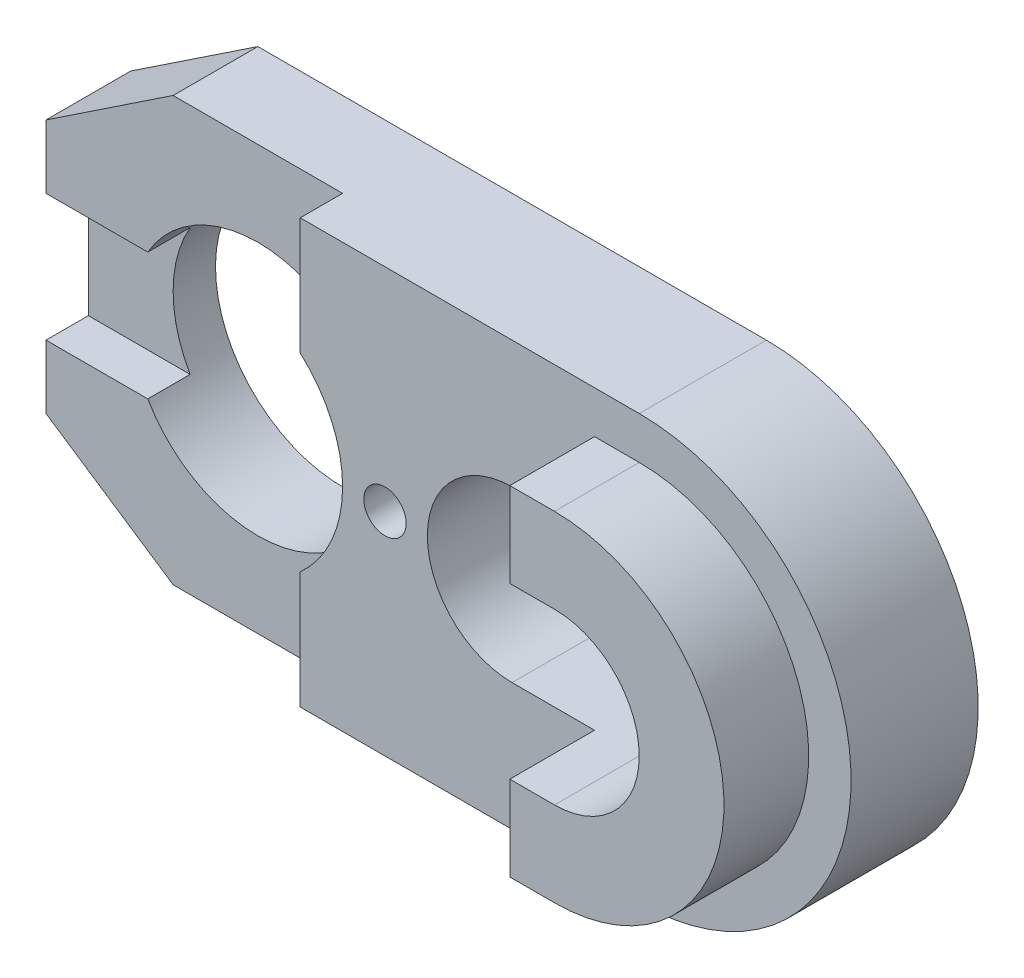
ISO-10303-21;
HEADER;
FILE_DESCRIPTION(('STEP AP214'),'2;1');
FILE_NAME('part.step','',(''),(''),'','','');
FILE_SCHEMA(('AUTOMOTIVE_DESIGN { 1 0 10303 214 1 1 1 1 }'));
ENDSEC;
DATA;
#1=APPLICATION_CONTEXT('core data for automotive mechanical design processes');
#2=APPLICATION_PROTOCOL_DEFINITION('international standard','automotive_design',2000,#1);
#3=PRODUCT_CONTEXT('',#1,'mechanical');
#4=PRODUCT('Part','Part','',(#3));
#5=PRODUCT_RELATED_PRODUCT_CATEGORY('part','',(#4));
#6=PRODUCT_DEFINITION_FORMATION('','',#4);
#7=PRODUCT_DEFINITION_CONTEXT('part definition',#1,'design');
#8=PRODUCT_DEFINITION('design','',#6,#7);
#9=PRODUCT_DEFINITION_SHAPE('','',#8);
#10=(LENGTH_UNIT() NAMED_UNIT(*) SI_UNIT(.MILLI.,.METRE.));
#11=(NAMED_UNIT(*) PLANE_ANGLE_UNIT() SI_UNIT($,.RADIAN.));
#12=(NAMED_UNIT(*) SI_UNIT($,.STERADIAN.) SOLID_ANGLE_UNIT());
#13=UNCERTAINTY_MEASURE_WITH_UNIT(LENGTH_MEASURE(1.E-05),#10,'distance_accuracy_value','');
#14=(GEOMETRIC_REPRESENTATION_CONTEXT(3) GLOBAL_UNCERTAINTY_ASSIGNED_CONTEXT((#13)) GLOBAL_UNIT_ASSIGNED_CONTEXT((#10,
#11,#12)) REPRESENTATION_CONTEXT('',''));
#15=CARTESIAN_POINT('',(0.,0.,0.));
#16=DIRECTION('',(0.,0.,1.));
#17=DIRECTION('',(1.,0.,0.));
#18=AXIS2_PLACEMENT_3D('',#15,#16,#17);
#19=CARTESIAN_POINT('',(-9.49576410080812,-20.,2.));
#20=DIRECTION('',(0.,0.,-1.));
#21=DIRECTION('',(-1.,0.,0.));
#22=AXIS2_PLACEMENT_3D('',#19,#20,#21);
#23=PLANE('',#22);
#24=CARTESIAN_POINT('',(-4.49576410080812,0.,2.));
#25=DIRECTION('',(0.,0.,-1.));
#26=DIRECTION('',(-1.,0.,0.));
#27=AXIS2_PLACEMENT_3D('',#24,#25,#26);
#28=CIRCLE('',#27,3.);
#29=CARTESIAN_POINT('',(-2.49576410080812,-2.23606797749979,2.));
#30=VERTEX_POINT('',#29);
#31=CARTESIAN_POINT('',(-7.09384031216144,-1.5,2.));
#32=VERTEX_POINT('',#31);
#33=EDGE_CURVE('E453',#30,#32,#28,.T.);
#34=ORIENTED_EDGE('',*,*,#33,.T.);
#35=DIRECTION('',(-1.,0.,0.));
#36=VECTOR('',#35,1.);
#37=CARTESIAN_POINT('',(-9.49576410080812,-1.5,2.));
#38=LINE('',#37,#36);
#39=CARTESIAN_POINT('',(-9.49576410080812,-1.5,2.));
#40=VERTEX_POINT('',#39);
#41=EDGE_CURVE('E161',#32,#40,#38,.T.);
#42=ORIENTED_EDGE('',*,*,#41,.T.);
#43=DIRECTION('',(0.,1.,0.));
#44=VECTOR('',#43,1.);
#45=CARTESIAN_POINT('',(-9.49576410080812,-20.,2.));
#46=LINE('',#45,#44);
#47=CARTESIAN_POINT('',(-9.49576410080812,-3.,2.));
#48=VERTEX_POINT('',#47);
#49=EDGE_CURVE('E334',#48,#40,#46,.T.);
#50=ORIENTED_EDGE('',*,*,#49,.F.);
#51=DIRECTION('',(-0.832050294337844,0.554700196225229,0.));
#52=VECTOR('',#51,1.);
#53=CARTESIAN_POINT('',(-9.49576410080812,-3.,2.));
#54=LINE('',#53,#52);
#55=CARTESIAN_POINT('',(-6.49576410080812,-5.,2.));
#56=VERTEX_POINT('',#55);
#57=EDGE_CURVE('E376',#56,#48,#54,.T.);
#58=ORIENTED_EDGE('',*,*,#57,.F.);
#59=DIRECTION('',(-1.,0.,0.));
#60=VECTOR('',#59,1.);
#61=CARTESIAN_POINT('',(-6.49576410080812,-5.,2.));
#62=LINE('',#61,#60);
#63=CARTESIAN_POINT('',(-2.49576410080812,-5.,2.));
#64=VERTEX_POINT('',#63);
#65=EDGE_CURVE('E373',#64,#56,#62,.T.);
#66=ORIENTED_EDGE('',*,*,#65,.F.);
#67=DIRECTION('',(0.,1.,0.));
#68=VECTOR('',#67,1.);
#69=CARTESIAN_POINT('',(-2.49576410080812,-20.,2.));
#70=LINE('',#69,#68);
#71=EDGE_CURVE('E335',#64,#30,#70,.T.);
#72=ORIENTED_EDGE('',*,*,#71,.T.);
#73=EDGE_LOOP('',(#34,#42,#50,#58,#66,#72));
#74=FACE_BOUND('',#73,.T.);
#75=ADVANCED_FACE('F153',(#74),#23,.F.);
#76=CARTESIAN_POINT('',(5.50423589919188,0.,5.));
#77=DIRECTION('',(0.,0.,-1.));
#78=DIRECTION('',(-1.,0.,0.));
#79=AXIS2_PLACEMENT_3D('',#76,#77,#78);
#80=PLANE('',#79);
#81=DIRECTION('',(-1.,0.,0.));
#82=VECTOR('',#81,1.);
#83=CARTESIAN_POINT('',(0.,-4.,5.));
#84=LINE('',#83,#82);
#85=CARTESIAN_POINT('',(5.50423589919188,-4.,5.));
#86=VERTEX_POINT('',#85);
#87=CARTESIAN_POINT('',(4.45006127435356,-4.,5.));
#88=VERTEX_POINT('',#87);
#89=EDGE_CURVE('E492',#86,#88,#84,.T.);
#90=ORIENTED_EDGE('',*,*,#89,.F.);
#91=CARTESIAN_POINT('',(5.50423589919188,0.,5.));
#92=DIRECTION('',(0.,0.,1.));
#93=DIRECTION('',(1.,0.,0.));
#94=AXIS2_PLACEMENT_3D('',#91,#92,#93);
#95=CIRCLE('',#94,4.);
#96=CARTESIAN_POINT('',(5.50423589919188,4.,5.));
#97=VERTEX_POINT('',#96);
#98=EDGE_CURVE('E506',#86,#97,#95,.T.);
#99=ORIENTED_EDGE('',*,*,#98,.T.);
#100=DIRECTION('',(-1.,0.,0.));
#101=VECTOR('',#100,1.);
#102=CARTESIAN_POINT('',(0.,4.,5.));
#103=LINE('',#102,#101);
#104=CARTESIAN_POINT('',(4.45006127435356,4.,5.));
#105=VERTEX_POINT('',#104);
#106=EDGE_CURVE('E513',#97,#105,#103,.T.);
#107=ORIENTED_EDGE('',*,*,#106,.T.);
#108=DIRECTION('',(0.,1.,0.));
#109=VECTOR('',#108,1.);
#110=CARTESIAN_POINT('',(4.45006127435356,-20.,5.));
#111=LINE('',#110,#109);
#112=CARTESIAN_POINT('',(4.45006127435356,2.,5.));
#113=VERTEX_POINT('',#112);
#114=EDGE_CURVE('E352',#113,#105,#111,.T.);
#115=ORIENTED_EDGE('',*,*,#114,.F.);
#116=DIRECTION('',(-1.,0.,0.));
#117=VECTOR('',#116,1.);
#118=CARTESIAN_POINT('',(2.50423589919188,2.,5.));
#119=LINE('',#118,#117);
#120=CARTESIAN_POINT('',(5.50423589919188,2.,5.));
#121=VERTEX_POINT('',#120);
#122=EDGE_CURVE('E386',#121,#113,#119,.T.);
#123=ORIENTED_EDGE('',*,*,#122,.F.);
#124=CARTESIAN_POINT('',(5.50423589919188,0.,5.));
#125=DIRECTION('',(0.,0.,1.));
#126=DIRECTION('',(1.,0.,0.));
#127=AXIS2_PLACEMENT_3D('',#124,#125,#126);
#128=CIRCLE('',#127,2.);
#129=CARTESIAN_POINT('',(5.50423589919188,-2.,5.));
#130=VERTEX_POINT('',#129);
#131=EDGE_CURVE('E382',#130,#121,#128,.T.);
#132=ORIENTED_EDGE('',*,*,#131,.F.);
#133=DIRECTION('',(1.,0.,0.));
#134=VECTOR('',#133,1.);
#135=CARTESIAN_POINT('',(2.50423589919188,-2.,5.));
#136=LINE('',#135,#134);
#137=CARTESIAN_POINT('',(4.45006127435356,-2.,5.));
#138=VERTEX_POINT('',#137);
#139=EDGE_CURVE('E380',#138,#130,#136,.T.);
#140=ORIENTED_EDGE('',*,*,#139,.F.);
#141=EDGE_CURVE('E351',#88,#138,#111,.T.);
#142=ORIENTED_EDGE('',*,*,#141,.F.);
#143=EDGE_LOOP('',(#90,#99,#107,#115,#123,#132,#140,#142));
#144=FACE_BOUND('',#143,.T.);
#145=ADVANCED_FACE('F585',(#144),#80,.F.);
#146=CARTESIAN_POINT('',(5.50423589919188,0.,5.));
#147=DIRECTION('',(0.,0.,-1.));
#148=DIRECTION('',(-1.,0.,0.));
#149=AXIS2_PLACEMENT_3D('',#146,#147,#148);
#150=CYLINDRICAL_SURFACE('',#149,5.);
#151=CARTESIAN_POINT('',(5.50423589919188,0.,3.));
#152=DIRECTION('',(0.,0.,-1.));
#153=DIRECTION('',(-1.,0.,0.));
#154=AXIS2_PLACEMENT_3D('',#151,#152,#153);
#155=CIRCLE('',#154,5.);
#156=CARTESIAN_POINT('',(5.50423589919188,5.,3.));
#157=VERTEX_POINT('',#156);
#158=CARTESIAN_POINT('',(5.50423589919188,-5.,3.));
#159=VERTEX_POINT('',#158);
#160=EDGE_CURVE('E320',#157,#159,#155,.T.);
#161=ORIENTED_EDGE('',*,*,#160,.T.);
#162=DIRECTION('',(0.,0.,-1.));
#163=VECTOR('',#162,1.);
#164=CARTESIAN_POINT('',(5.50423589919188,-5.,5.));
#165=LINE('',#164,#163);
#166=CARTESIAN_POINT('',(5.50423589919188,-5.,0.));
#167=VERTEX_POINT('',#166);
#168=EDGE_CURVE('E437',#159,#167,#165,.T.);
#169=ORIENTED_EDGE('',*,*,#168,.T.);
#170=CARTESIAN_POINT('',(5.50423589919188,0.,0.));
#171=DIRECTION('',(0.,0.,1.));
#172=DIRECTION('',(-1.,0.,0.));
#173=AXIS2_PLACEMENT_3D('',#170,#171,#172);
#174=CIRCLE('',#173,5.);
#175=CARTESIAN_POINT('',(5.50423589919188,5.,0.));
#176=VERTEX_POINT('',#175);
#177=EDGE_CURVE('E422',#167,#176,#174,.T.);
#178=ORIENTED_EDGE('',*,*,#177,.T.);
#179=DIRECTION('',(0.,0.,-1.));
#180=VECTOR('',#179,1.);
#181=CARTESIAN_POINT('',(5.50423589919188,5.,5.));
#182=LINE('',#181,#180);
#183=EDGE_CURVE('E435',#157,#176,#182,.T.);
#184=ORIENTED_EDGE('',*,*,#183,.F.);
#185=EDGE_LOOP('',(#161,#169,#178,#184));
#186=FACE_BOUND('',#185,.T.);
#187=ADVANCED_FACE('F539',(#186),#150,.T.);
#188=CARTESIAN_POINT('',(-6.49576410080812,-5.,5.));
#189=DIRECTION('',(0.,1.,0.));
#190=DIRECTION('',(0.,0.,1.));
#191=AXIS2_PLACEMENT_3D('',#188,#189,#190);
#192=PLANE('',#191);
#193=ORIENTED_EDGE('',*,*,#168,.F.);
#194=DIRECTION('',(-1.,0.,0.));
#195=VECTOR('',#194,1.);
#196=CARTESIAN_POINT('',(-6.49576410080812,-5.,3.));
#197=LINE('',#196,#195);
#198=CARTESIAN_POINT('',(-2.49576410080812,-5.,3.));
#199=VERTEX_POINT('',#198);
#200=EDGE_CURVE('E366',#159,#199,#197,.T.);
#201=ORIENTED_EDGE('',*,*,#200,.T.);
#202=DIRECTION('',(0.,0.,-1.));
#203=VECTOR('',#202,1.);
#204=CARTESIAN_POINT('',(-2.49576410080812,-5.,5.));
#205=LINE('',#204,#203);
#206=EDGE_CURVE('E369',#199,#64,#205,.T.);
#207=ORIENTED_EDGE('',*,*,#206,.T.);
#208=ORIENTED_EDGE('',*,*,#65,.T.);
#209=DIRECTION('',(0.,0.,-1.));
#210=VECTOR('',#209,1.);
#211=CARTESIAN_POINT('',(-6.49576410080812,-5.,5.));
#212=LINE('',#211,#210);
#213=CARTESIAN_POINT('',(-6.49576410080812,-5.,0.));
#214=VERTEX_POINT('',#213);
#215=EDGE_CURVE('E439',#56,#214,#212,.T.);
#216=ORIENTED_EDGE('',*,*,#215,.T.);
#217=DIRECTION('',(1.,0.,0.));
#218=VECTOR('',#217,1.);
#219=CARTESIAN_POINT('',(-6.49576410080812,-5.,0.));
#220=LINE('',#219,#218);
#221=EDGE_CURVE('E419',#214,#167,#220,.T.);
#222=ORIENTED_EDGE('',*,*,#221,.T.);
#223=EDGE_LOOP('',(#193,#201,#207,#208,#216,#222));
#224=FACE_BOUND('',#223,.T.);
#225=ADVANCED_FACE('F477',(#224),#192,.F.);
#226=CARTESIAN_POINT('',(-6.49576410080812,5.,5.));
#227=DIRECTION('',(0.,-1.,0.));
#228=DIRECTION('',(1.,0.,0.));
#229=AXIS2_PLACEMENT_3D('',#226,#227,#228);
#230=PLANE('',#229);
#231=DIRECTION('',(-1.,0.,0.));
#232=VECTOR('',#231,1.);
#233=CARTESIAN_POINT('',(-2.49576410080812,5.,3.));
#234=LINE('',#233,#232);
#235=CARTESIAN_POINT('',(-2.49576410080812,5.,3.));
#236=VERTEX_POINT('',#235);
#237=EDGE_CURVE('E523',#157,#236,#234,.T.);
#238=ORIENTED_EDGE('',*,*,#237,.F.);
#239=ORIENTED_EDGE('',*,*,#183,.T.);
#240=DIRECTION('',(-1.,0.,0.));
#241=VECTOR('',#240,1.);
#242=CARTESIAN_POINT('',(-6.49576410080812,5.,0.));
#243=LINE('',#242,#241);
#244=CARTESIAN_POINT('',(-6.49576410080812,5.,0.));
#245=VERTEX_POINT('',#244);
#246=EDGE_CURVE('E425',#176,#245,#243,.T.);
#247=ORIENTED_EDGE('',*,*,#246,.T.);
#248=DIRECTION('',(0.,0.,-1.));
#249=VECTOR('',#248,1.);
#250=CARTESIAN_POINT('',(-6.49576410080812,5.,5.));
#251=LINE('',#250,#249);
#252=CARTESIAN_POINT('',(-6.49576410080812,5.,2.));
#253=VERTEX_POINT('',#252);
#254=EDGE_CURVE('E433',#253,#245,#251,.T.);
#255=ORIENTED_EDGE('',*,*,#254,.F.);
#256=DIRECTION('',(-1.,0.,0.));
#257=VECTOR('',#256,1.);
#258=CARTESIAN_POINT('',(-9.49576410080812,5.,2.));
#259=LINE('',#258,#257);
#260=CARTESIAN_POINT('',(-2.49576410080812,5.,2.));
#261=VERTEX_POINT('',#260);
#262=EDGE_CURVE('E342',#261,#253,#259,.T.);
#263=ORIENTED_EDGE('',*,*,#262,.F.);
#264=DIRECTION('',(0.,0.,-1.));
#265=VECTOR('',#264,1.);
#266=CARTESIAN_POINT('',(-2.49576410080812,5.,2.));
#267=LINE('',#266,#265);
#268=EDGE_CURVE('E525',#236,#261,#267,.T.);
#269=ORIENTED_EDGE('',*,*,#268,.F.);
#270=EDGE_LOOP('',(#238,#239,#247,#255,#263,#269));
#271=FACE_BOUND('',#270,.T.);
#272=ADVANCED_FACE('F535',(#271),#230,.F.);
#273=CARTESIAN_POINT('',(4.45006127435356,-20.,3.));
#274=DIRECTION('',(1.,0.,0.));
#275=DIRECTION('',(0.,1.,0.));
#276=AXIS2_PLACEMENT_3D('',#273,#274,#275);
#277=PLANE('',#276);
#278=DIRECTION('',(0.,0.,1.));
#279=VECTOR('',#278,1.);
#280=CARTESIAN_POINT('',(4.45006127435356,4.,3.));
#281=LINE('',#280,#279);
#282=CARTESIAN_POINT('',(4.45006127435356,4.,3.));
#283=VERTEX_POINT('',#282);
#284=EDGE_CURVE('E515',#283,#105,#281,.T.);
#285=ORIENTED_EDGE('',*,*,#284,.F.);
#286=DIRECTION('',(0.,1.,0.));
#287=VECTOR('',#286,1.);
#288=CARTESIAN_POINT('',(4.45006127435356,-20.,3.));
#289=LINE('',#288,#287);
#290=CARTESIAN_POINT('',(4.45006127435356,2.,3.));
#291=VERTEX_POINT('',#290);
#292=EDGE_CURVE('E348',#291,#283,#289,.T.);
#293=ORIENTED_EDGE('',*,*,#292,.F.);
#294=DIRECTION('',(0.,0.,1.));
#295=VECTOR('',#294,1.);
#296=CARTESIAN_POINT('',(4.45006127435356,2.,5.));
#297=LINE('',#296,#295);
#298=EDGE_CURVE('E443',#291,#113,#297,.T.);
#299=ORIENTED_EDGE('',*,*,#298,.T.);
#300=ORIENTED_EDGE('',*,*,#114,.T.);
#301=EDGE_LOOP('',(#285,#293,#299,#300));
#302=FACE_BOUND('',#301,.T.);
#303=ADVANCED_FACE('F557',(#302),#277,.F.);
#304=CARTESIAN_POINT('',(5.50423589919188,0.,0.));
#305=DIRECTION('',(0.,0.,-1.));
#306=DIRECTION('',(-1.,0.,0.));
#307=AXIS2_PLACEMENT_3D('',#304,#305,#306);
#308=PLANE('',#307);
#309=CARTESIAN_POINT('',(-4.49576410080812,0.,0.));
#310=DIRECTION('',(0.,0.,1.));
#311=DIRECTION('',(1.,0.,0.));
#312=AXIS2_PLACEMENT_3D('',#309,#310,#311);
#313=CIRCLE('',#312,3.);
#314=CARTESIAN_POINT('',(-1.49576410080812,0.,0.));
#315=VERTEX_POINT('',#314);
#316=EDGE_CURVE('E410',#315,#315,#313,.T.);
#317=ORIENTED_EDGE('',*,*,#316,.T.);
#318=EDGE_LOOP('',(#317));
#319=FACE_BOUND('',#318,.T.);
#320=DIRECTION('',(0.,-1.,0.));
#321=VECTOR('',#320,1.);
#322=CARTESIAN_POINT('',(-9.49576410080812,-3.,0.));
#323=LINE('',#322,#321);
#324=CARTESIAN_POINT('',(-9.49576410080812,3.,0.));
#325=VERTEX_POINT('',#324);
#326=CARTESIAN_POINT('',(-9.49576410080812,-3.,0.));
#327=VERTEX_POINT('',#326);
#328=EDGE_CURVE('E413',#325,#327,#323,.T.);
#329=ORIENTED_EDGE('',*,*,#328,.F.);
#330=DIRECTION('',(-0.832050294337844,-0.554700196225229,0.));
#331=VECTOR('',#330,1.);
#332=CARTESIAN_POINT('',(-9.49576410080812,3.,0.));
#333=LINE('',#332,#331);
#334=EDGE_CURVE('E428',#245,#325,#333,.T.);
#335=ORIENTED_EDGE('',*,*,#334,.F.);
#336=ORIENTED_EDGE('',*,*,#246,.F.);
#337=ORIENTED_EDGE('',*,*,#177,.F.);
#338=ORIENTED_EDGE('',*,*,#221,.F.);
#339=DIRECTION('',(0.832050294337844,-0.554700196225229,0.));
#340=VECTOR('',#339,1.);
#341=CARTESIAN_POINT('',(-9.49576410080812,-3.,0.));
#342=LINE('',#341,#340);
#343=EDGE_CURVE('E416',#327,#214,#342,.T.);
#344=ORIENTED_EDGE('',*,*,#343,.F.);
#345=EDGE_LOOP('',(#329,#335,#336,#337,#338,#344));
#346=FACE_BOUND('',#345,.T.);
#347=CARTESIAN_POINT('',(-0.495764100808119,0.,0.));
#348=DIRECTION('',(0.,0.,1.));
#349=DIRECTION('',(1.,0.,0.));
#350=AXIS2_PLACEMENT_3D('',#347,#348,#349);
#351=CIRCLE('',#350,0.5);
#352=CARTESIAN_POINT('',(0.004235899191881,0.,0.));
#353=VERTEX_POINT('',#352);
#354=EDGE_CURVE('E407',#353,#353,#351,.T.);
#355=ORIENTED_EDGE('',*,*,#354,.T.);
#356=EDGE_LOOP('',(#355));
#357=FACE_BOUND('',#356,.T.);
#358=DIRECTION('',(-1.,0.,0.));
#359=VECTOR('',#358,1.);
#360=CARTESIAN_POINT('',(2.50423589919188,2.,0.));
#361=LINE('',#360,#359);
#362=CARTESIAN_POINT('',(5.50423589919188,2.,0.));
#363=VERTEX_POINT('',#362);
#364=CARTESIAN_POINT('',(2.50423589919188,2.,0.));
#365=VERTEX_POINT('',#364);
#366=EDGE_CURVE('E383',#363,#365,#361,.T.);
#367=ORIENTED_EDGE('',*,*,#366,.T.);
#368=CARTESIAN_POINT('',(2.50423589919188,0.,0.));
#369=DIRECTION('',(0.,0.,1.));
#370=DIRECTION('',(1.,0.,0.));
#371=AXIS2_PLACEMENT_3D('',#368,#369,#370);
#372=CIRCLE('',#371,2.);
#373=CARTESIAN_POINT('',(2.50423589919188,-2.,0.));
#374=VERTEX_POINT('',#373);
#375=EDGE_CURVE('E379',#365,#374,#372,.T.);
#376=ORIENTED_EDGE('',*,*,#375,.T.);
#377=DIRECTION('',(1.,0.,0.));
#378=VECTOR('',#377,1.);
#379=CARTESIAN_POINT('',(2.50423589919188,-2.,0.));
#380=LINE('',#379,#378);
#381=CARTESIAN_POINT('',(5.50423589919188,-2.,0.));
#382=VERTEX_POINT('',#381);
#383=EDGE_CURVE('E392',#374,#382,#380,.T.);
#384=ORIENTED_EDGE('',*,*,#383,.T.);
#385=CARTESIAN_POINT('',(5.50423589919188,0.,0.));
#386=DIRECTION('',(0.,0.,1.));
#387=DIRECTION('',(1.,0.,0.));
#388=AXIS2_PLACEMENT_3D('',#385,#386,#387);
#389=CIRCLE('',#388,2.);
#390=EDGE_CURVE('E395',#382,#363,#389,.T.);
#391=ORIENTED_EDGE('',*,*,#390,.T.);
#392=EDGE_LOOP('',(#367,#376,#384,#391));
#393=FACE_BOUND('',#392,.T.);
#394=ADVANCED_FACE('F470',(#319,#346,#357,#393),#308,.T.);
#395=CARTESIAN_POINT('',(-9.49576410080812,-3.,5.));
#396=DIRECTION('',(1.,0.,0.));
#397=DIRECTION('',(0.,0.,-1.));
#398=AXIS2_PLACEMENT_3D('',#395,#396,#397);
#399=PLANE('',#398);
#400=ORIENTED_EDGE('',*,*,#49,.T.);
#401=DIRECTION('',(0.,0.,1.));
#402=VECTOR('',#401,1.);
#403=CARTESIAN_POINT('',(-9.49576410080812,-1.5,2.));
#404=LINE('',#403,#402);
#405=CARTESIAN_POINT('',(-9.49576410080812,-1.5,0.999999999999999));
#406=VERTEX_POINT('',#405);
#407=EDGE_CURVE('E462',#406,#40,#404,.T.);
#408=ORIENTED_EDGE('',*,*,#407,.F.);
#409=DIRECTION('',(0.,-1.,0.));
#410=VECTOR('',#409,1.);
#411=CARTESIAN_POINT('',(-9.49576410080812,1.5,0.999999999999999));
#412=LINE('',#411,#410);
#413=CARTESIAN_POINT('',(-9.49576410080812,1.5,0.999999999999999));
#414=VERTEX_POINT('',#413);
#415=EDGE_CURVE('E328',#414,#406,#412,.T.);
#416=ORIENTED_EDGE('',*,*,#415,.F.);
#417=DIRECTION('',(0.,0.,-1.));
#418=VECTOR('',#417,1.);
#419=CARTESIAN_POINT('',(-9.49576410080812,1.5,2.));
#420=LINE('',#419,#418);
#421=CARTESIAN_POINT('',(-9.49576410080812,1.5,2.));
#422=VERTEX_POINT('',#421);
#423=EDGE_CURVE('E315',#422,#414,#420,.T.);
#424=ORIENTED_EDGE('',*,*,#423,.F.);
#425=CARTESIAN_POINT('',(-9.49576410080812,3.,2.));
#426=VERTEX_POINT('',#425);
#427=EDGE_CURVE('E324',#422,#426,#46,.T.);
#428=ORIENTED_EDGE('',*,*,#427,.T.);
#429=DIRECTION('',(0.,0.,-1.));
#430=VECTOR('',#429,1.);
#431=CARTESIAN_POINT('',(-9.49576410080812,3.,5.));
#432=LINE('',#431,#430);
#433=EDGE_CURVE('E431',#426,#325,#432,.T.);
#434=ORIENTED_EDGE('',*,*,#433,.T.);
#435=ORIENTED_EDGE('',*,*,#328,.T.);
#436=DIRECTION('',(0.,0.,-1.));
#437=VECTOR('',#436,1.);
#438=CARTESIAN_POINT('',(-9.49576410080812,-3.,5.));
#439=LINE('',#438,#437);
#440=EDGE_CURVE('E441',#48,#327,#439,.T.);
#441=ORIENTED_EDGE('',*,*,#440,.F.);
#442=EDGE_LOOP('',(#400,#408,#416,#424,#428,#434,#435,#441));
#443=FACE_BOUND('',#442,.T.);
#444=ADVANCED_FACE('F155',(#443),#399,.F.);
#445=CARTESIAN_POINT('',(-9.49576410080812,-3.,5.));
#446=DIRECTION('',(0.554700196225229,0.832050294337844,0.));
#447=DIRECTION('',(-0.832050294337844,0.554700196225229,0.));
#448=AXIS2_PLACEMENT_3D('',#445,#446,#447);
#449=PLANE('',#448);
#450=ORIENTED_EDGE('',*,*,#215,.F.);
#451=ORIENTED_EDGE('',*,*,#57,.T.);
#452=ORIENTED_EDGE('',*,*,#440,.T.);
#453=ORIENTED_EDGE('',*,*,#343,.T.);
#454=EDGE_LOOP('',(#450,#451,#452,#453));
#455=FACE_BOUND('',#454,.T.);
#456=ADVANCED_FACE('F467',(#455),#449,.F.);
#457=CARTESIAN_POINT('',(-9.49576410080812,3.,5.));
#458=DIRECTION('',(0.554700196225229,-0.832050294337844,0.));
#459=DIRECTION('',(0.832050294337844,0.554700196225229,0.));
#460=AXIS2_PLACEMENT_3D('',#457,#458,#459);
#461=PLANE('',#460);
#462=ORIENTED_EDGE('',*,*,#433,.F.);
#463=DIRECTION('',(0.832050294337844,0.554700196225229,0.));
#464=VECTOR('',#463,1.);
#465=CARTESIAN_POINT('',(-9.49576410080812,3.,2.));
#466=LINE('',#465,#464);
#467=EDGE_CURVE('E332',#426,#253,#466,.T.);
#468=ORIENTED_EDGE('',*,*,#467,.T.);
#469=ORIENTED_EDGE('',*,*,#254,.T.);
#470=ORIENTED_EDGE('',*,*,#334,.T.);
#471=EDGE_LOOP('',(#462,#468,#469,#470));
#472=FACE_BOUND('',#471,.T.);
#473=ADVANCED_FACE('F534',(#472),#461,.F.);
#474=CARTESIAN_POINT('',(-4.49576410080812,0.,5.));
#475=DIRECTION('',(0.,0.,-1.));
#476=DIRECTION('',(-1.,0.,0.));
#477=AXIS2_PLACEMENT_3D('',#474,#475,#476);
#478=CYLINDRICAL_SURFACE('',#477,3.);
#479=DIRECTION('',(0.,0.,-1.));
#480=VECTOR('',#479,1.);
#481=CARTESIAN_POINT('',(-7.09384031216144,-1.5,5.));
#482=LINE('',#481,#480);
#483=CARTESIAN_POINT('',(-7.09384031216144,-1.5,0.999999999999998));
#484=VERTEX_POINT('',#483);
#485=EDGE_CURVE('E490',#32,#484,#482,.T.);
#486=ORIENTED_EDGE('',*,*,#485,.F.);
#487=ORIENTED_EDGE('',*,*,#33,.F.);
#488=DIRECTION('',(0.,0.,-1.));
#489=VECTOR('',#488,1.);
#490=CARTESIAN_POINT('',(-2.49576410080812,-2.23606797749979,5.));
#491=LINE('',#490,#489);
#492=CARTESIAN_POINT('',(-2.49576410080812,-2.23606797749979,3.));
#493=VERTEX_POINT('',#492);
#494=EDGE_CURVE('E450',#493,#30,#491,.T.);
#495=ORIENTED_EDGE('',*,*,#494,.F.);
#496=CARTESIAN_POINT('',(-4.49576410080812,0.,3.));
#497=DIRECTION('',(0.,0.,-1.));
#498=DIRECTION('',(-1.,0.,0.));
#499=AXIS2_PLACEMENT_3D('',#496,#497,#498);
#500=CIRCLE('',#499,3.);
#501=CARTESIAN_POINT('',(-2.49576410080812,2.23606797749979,3.));
#502=VERTEX_POINT('',#501);
#503=EDGE_CURVE('E364',#502,#493,#500,.T.);
#504=ORIENTED_EDGE('',*,*,#503,.F.);
#505=DIRECTION('',(0.,0.,-1.));
#506=VECTOR('',#505,1.);
#507=CARTESIAN_POINT('',(-2.49576410080812,2.23606797749979,5.));
#508=LINE('',#507,#506);
#509=CARTESIAN_POINT('',(-2.49576410080812,2.23606797749979,2.));
#510=VERTEX_POINT('',#509);
#511=EDGE_CURVE('E448',#510,#502,#508,.F.);
#512=ORIENTED_EDGE('',*,*,#511,.F.);
#513=CARTESIAN_POINT('',(-7.09384031216143,1.5,2.));
#514=VERTEX_POINT('',#513);
#515=EDGE_CURVE('E452',#514,#510,#28,.T.);
#516=ORIENTED_EDGE('',*,*,#515,.F.);
#517=DIRECTION('',(0.,0.,-1.));
#518=VECTOR('',#517,1.);
#519=CARTESIAN_POINT('',(-7.09384031216143,1.5,5.));
#520=LINE('',#519,#518);
#521=CARTESIAN_POINT('',(-7.09384031216143,1.5,0.999999999999999));
#522=VERTEX_POINT('',#521);
#523=EDGE_CURVE('E168',#522,#514,#520,.F.);
#524=ORIENTED_EDGE('',*,*,#523,.F.);
#525=CARTESIAN_POINT('',(-4.49576410080812,0.,0.999999999999998));
#526=DIRECTION('',(0.,0.,-1.));
#527=DIRECTION('',(0.,1.,0.));
#528=AXIS2_PLACEMENT_3D('',#525,#526,#527);
#529=CIRCLE('',#528,3.);
#530=EDGE_CURVE('E12',#484,#522,#529,.T.);
#531=ORIENTED_EDGE('',*,*,#530,.F.);
#532=EDGE_LOOP('',(#486,#487,#495,#504,#512,#516,#524,#531));
#533=FACE_BOUND('',#532,.T.);
#534=ORIENTED_EDGE('',*,*,#316,.F.);
#535=EDGE_LOOP('',(#534));
#536=FACE_BOUND('',#535,.T.);
#537=ADVANCED_FACE('F486',(#533,#536),#478,.F.);
#538=CARTESIAN_POINT('',(-0.495764100808119,0.,5.));
#539=DIRECTION('',(0.,0.,-1.));
#540=DIRECTION('',(-1.,0.,0.));
#541=AXIS2_PLACEMENT_3D('',#538,#539,#540);
#542=CYLINDRICAL_SURFACE('',#541,0.5);
#543=CARTESIAN_POINT('',(-0.495764100808119,0.,3.));
#544=DIRECTION('',(0.,0.,-1.));
#545=DIRECTION('',(-1.,0.,0.));
#546=AXIS2_PLACEMENT_3D('',#543,#544,#545);
#547=CIRCLE('',#546,0.5);
#548=CARTESIAN_POINT('',(-0.995764100808119,0.,3.));
#549=VERTEX_POINT('',#548);
#550=EDGE_CURVE('E361',#549,#549,#547,.T.);
#551=ORIENTED_EDGE('',*,*,#550,.F.);
#552=EDGE_LOOP('',(#551));
#553=FACE_BOUND('',#552,.T.);
#554=ORIENTED_EDGE('',*,*,#354,.F.);
#555=EDGE_LOOP('',(#554));
#556=FACE_BOUND('',#555,.T.);
#557=ADVANCED_FACE('F549',(#553,#556),#542,.F.);
#558=CARTESIAN_POINT('',(2.50423589919188,0.,5.));
#559=DIRECTION('',(0.,0.,-1.));
#560=DIRECTION('',(-1.,0.,0.));
#561=AXIS2_PLACEMENT_3D('',#558,#559,#560);
#562=CYLINDRICAL_SURFACE('',#561,2.);
#563=CARTESIAN_POINT('',(2.50423589919188,0.,3.));
#564=DIRECTION('',(0.,0.,-1.));
#565=DIRECTION('',(-1.,0.,0.));
#566=AXIS2_PLACEMENT_3D('',#563,#564,#565);
#567=CIRCLE('',#566,2.);
#568=CARTESIAN_POINT('',(2.50423589919188,-2.,3.));
#569=VERTEX_POINT('',#568);
#570=CARTESIAN_POINT('',(2.50423589919188,2.,3.));
#571=VERTEX_POINT('',#570);
#572=EDGE_CURVE('E357',#569,#571,#567,.T.);
#573=ORIENTED_EDGE('',*,*,#572,.F.);
#574=DIRECTION('',(0.,0.,-1.));
#575=VECTOR('',#574,1.);
#576=CARTESIAN_POINT('',(2.50423589919188,-2.,5.));
#577=LINE('',#576,#575);
#578=EDGE_CURVE('E405',#569,#374,#577,.T.);
#579=ORIENTED_EDGE('',*,*,#578,.T.);
#580=ORIENTED_EDGE('',*,*,#375,.F.);
#581=DIRECTION('',(0.,0.,-1.));
#582=VECTOR('',#581,1.);
#583=CARTESIAN_POINT('',(2.50423589919188,2.,5.));
#584=LINE('',#583,#582);
#585=EDGE_CURVE('E389',#571,#365,#584,.T.);
#586=ORIENTED_EDGE('',*,*,#585,.F.);
#587=EDGE_LOOP('',(#573,#579,#580,#586));
#588=FACE_BOUND('',#587,.T.);
#589=ADVANCED_FACE('F552',(#588),#562,.F.);
#590=CARTESIAN_POINT('',(2.50423589919188,-2.,5.));
#591=DIRECTION('',(0.,1.,0.));
#592=DIRECTION('',(0.,0.,1.));
#593=AXIS2_PLACEMENT_3D('',#590,#591,#592);
#594=PLANE('',#593);
#595=DIRECTION('',(-1.,0.,0.));
#596=VECTOR('',#595,1.);
#597=CARTESIAN_POINT('',(2.50423589919188,-2.,3.));
#598=LINE('',#597,#596);
#599=CARTESIAN_POINT('',(4.45006127435356,-2.,3.));
#600=VERTEX_POINT('',#599);
#601=EDGE_CURVE('E359',#600,#569,#598,.T.);
#602=ORIENTED_EDGE('',*,*,#601,.F.);
#603=DIRECTION('',(0.,0.,-1.));
#604=VECTOR('',#603,1.);
#605=CARTESIAN_POINT('',(4.45006127435356,-2.,5.));
#606=LINE('',#605,#604);
#607=EDGE_CURVE('E337',#138,#600,#606,.T.);
#608=ORIENTED_EDGE('',*,*,#607,.F.);
#609=ORIENTED_EDGE('',*,*,#139,.T.);
#610=DIRECTION('',(0.,0.,-1.));
#611=VECTOR('',#610,1.);
#612=CARTESIAN_POINT('',(5.50423589919188,-2.,5.));
#613=LINE('',#612,#611);
#614=EDGE_CURVE('E403',#130,#382,#613,.T.);
#615=ORIENTED_EDGE('',*,*,#614,.T.);
#616=ORIENTED_EDGE('',*,*,#383,.F.);
#617=ORIENTED_EDGE('',*,*,#578,.F.);
#618=EDGE_LOOP('',(#602,#608,#609,#615,#616,#617));
#619=FACE_BOUND('',#618,.T.);
#620=ADVANCED_FACE('F574',(#619),#594,.T.);
#621=CARTESIAN_POINT('',(5.50423589919188,0.,5.));
#622=DIRECTION('',(0.,0.,-1.));
#623=DIRECTION('',(-1.,0.,0.));
#624=AXIS2_PLACEMENT_3D('',#621,#622,#623);
#625=CYLINDRICAL_SURFACE('',#624,2.);
#626=ORIENTED_EDGE('',*,*,#390,.F.);
#627=ORIENTED_EDGE('',*,*,#614,.F.);
#628=ORIENTED_EDGE('',*,*,#131,.T.);
#629=DIRECTION('',(0.,0.,-1.));
#630=VECTOR('',#629,1.);
#631=CARTESIAN_POINT('',(5.50423589919188,2.,5.));
#632=LINE('',#631,#630);
#633=EDGE_CURVE('E401',#121,#363,#632,.T.);
#634=ORIENTED_EDGE('',*,*,#633,.T.);
#635=EDGE_LOOP('',(#626,#627,#628,#634));
#636=FACE_BOUND('',#635,.T.);
#637=ADVANCED_FACE('F580',(#636),#625,.F.);
#638=CARTESIAN_POINT('',(2.50423589919188,2.,5.));
#639=DIRECTION('',(0.,-1.,0.));
#640=DIRECTION('',(0.,0.,-1.));
#641=AXIS2_PLACEMENT_3D('',#638,#639,#640);
#642=PLANE('',#641);
#643=DIRECTION('',(1.,0.,0.));
#644=VECTOR('',#643,1.);
#645=CARTESIAN_POINT('',(2.50423589919188,2.,3.));
#646=LINE('',#645,#644);
#647=EDGE_CURVE('E445',#571,#291,#646,.T.);
#648=ORIENTED_EDGE('',*,*,#647,.F.);
#649=ORIENTED_EDGE('',*,*,#585,.T.);
#650=ORIENTED_EDGE('',*,*,#366,.F.);
#651=ORIENTED_EDGE('',*,*,#633,.F.);
#652=ORIENTED_EDGE('',*,*,#122,.T.);
#653=ORIENTED_EDGE('',*,*,#298,.F.);
#654=EDGE_LOOP('',(#648,#649,#650,#651,#652,#653));
#655=FACE_BOUND('',#654,.T.);
#656=ADVANCED_FACE('F565',(#655),#642,.T.);
#657=CARTESIAN_POINT('',(4.45006127435356,-4.,3.));
#658=VERTEX_POINT('',#657);
#659=EDGE_CURVE('E347',#658,#600,#289,.T.);
#660=ORIENTED_EDGE('',*,*,#659,.F.);
#661=DIRECTION('',(0.,0.,1.));
#662=VECTOR('',#661,1.);
#663=CARTESIAN_POINT('',(4.45006127435356,-4.,3.));
#664=LINE('',#663,#662);
#665=EDGE_CURVE('E503',#658,#88,#664,.T.);
#666=ORIENTED_EDGE('',*,*,#665,.T.);
#667=ORIENTED_EDGE('',*,*,#141,.T.);
#668=ORIENTED_EDGE('',*,*,#607,.T.);
#669=EDGE_LOOP('',(#660,#666,#667,#668));
#670=FACE_BOUND('',#669,.T.);
#671=ADVANCED_FACE('F591',(#670),#277,.F.);
#672=CARTESIAN_POINT('',(-2.49576410080812,-20.,2.));
#673=DIRECTION('',(1.,0.,0.));
#674=DIRECTION('',(0.,1.,0.));
#675=AXIS2_PLACEMENT_3D('',#672,#673,#674);
#676=PLANE('',#675);
#677=ORIENTED_EDGE('',*,*,#511,.T.);
#678=DIRECTION('',(0.,1.,0.));
#679=VECTOR('',#678,1.);
#680=CARTESIAN_POINT('',(-2.49576410080812,-20.,3.));
#681=LINE('',#680,#679);
#682=EDGE_CURVE('E176',#502,#236,#681,.T.);
#683=ORIENTED_EDGE('',*,*,#682,.T.);
#684=ORIENTED_EDGE('',*,*,#268,.T.);
#685=EDGE_CURVE('E339',#510,#261,#70,.T.);
#686=ORIENTED_EDGE('',*,*,#685,.F.);
#687=EDGE_LOOP('',(#677,#683,#684,#686));
#688=FACE_BOUND('',#687,.T.);
#689=ADVANCED_FACE('F624',(#688),#676,.F.);
#690=EDGE_CURVE('E345',#199,#493,#681,.T.);
#691=ORIENTED_EDGE('',*,*,#690,.T.);
#692=ORIENTED_EDGE('',*,*,#494,.T.);
#693=ORIENTED_EDGE('',*,*,#71,.F.);
#694=ORIENTED_EDGE('',*,*,#206,.F.);
#695=EDGE_LOOP('',(#691,#692,#693,#694));
#696=FACE_BOUND('',#695,.T.);
#697=ADVANCED_FACE('F481',(#696),#676,.F.);
#698=ORIENTED_EDGE('',*,*,#427,.F.);
#699=DIRECTION('',(1.,0.,0.));
#700=VECTOR('',#699,1.);
#701=CARTESIAN_POINT('',(-9.49576410080812,1.5,2.));
#702=LINE('',#701,#700);
#703=EDGE_CURVE('E312',#422,#514,#702,.T.);
#704=ORIENTED_EDGE('',*,*,#703,.T.);
#705=ORIENTED_EDGE('',*,*,#515,.T.);
#706=ORIENTED_EDGE('',*,*,#685,.T.);
#707=ORIENTED_EDGE('',*,*,#262,.T.);
#708=ORIENTED_EDGE('',*,*,#467,.F.);
#709=EDGE_LOOP('',(#698,#704,#705,#706,#707,#708));
#710=FACE_BOUND('',#709,.T.);
#711=ADVANCED_FACE('F330',(#710),#23,.F.);
#712=CARTESIAN_POINT('',(9.50423589919188,-20.,3.));
#713=DIRECTION('',(0.,0.,-1.));
#714=DIRECTION('',(-1.,0.,0.));
#715=AXIS2_PLACEMENT_3D('',#712,#713,#714);
#716=PLANE('',#715);
#717=ORIENTED_EDGE('',*,*,#292,.T.);
#718=DIRECTION('',(-1.,0.,0.));
#719=VECTOR('',#718,1.);
#720=CARTESIAN_POINT('',(0.,4.,3.));
#721=LINE('',#720,#719);
#722=CARTESIAN_POINT('',(5.50423589919188,4.,3.));
#723=VERTEX_POINT('',#722);
#724=EDGE_CURVE('E512',#723,#283,#721,.T.);
#725=ORIENTED_EDGE('',*,*,#724,.F.);
#726=CARTESIAN_POINT('',(5.50423589919188,0.,3.));
#727=DIRECTION('',(0.,0.,1.));
#728=DIRECTION('',(1.,0.,0.));
#729=AXIS2_PLACEMENT_3D('',#726,#727,#728);
#730=CIRCLE('',#729,4.);
#731=CARTESIAN_POINT('',(5.50423589919188,-4.,3.));
#732=VERTEX_POINT('',#731);
#733=EDGE_CURVE('E509',#732,#723,#730,.T.);
#734=ORIENTED_EDGE('',*,*,#733,.F.);
#735=DIRECTION('',(-1.,0.,0.));
#736=VECTOR('',#735,1.);
#737=CARTESIAN_POINT('',(0.,-4.,3.));
#738=LINE('',#737,#736);
#739=EDGE_CURVE('E494',#732,#658,#738,.T.);
#740=ORIENTED_EDGE('',*,*,#739,.T.);
#741=ORIENTED_EDGE('',*,*,#659,.T.);
#742=ORIENTED_EDGE('',*,*,#601,.T.);
#743=ORIENTED_EDGE('',*,*,#572,.T.);
#744=ORIENTED_EDGE('',*,*,#647,.T.);
#745=EDGE_LOOP('',(#717,#725,#734,#740,#741,#742,#743,#744));
#746=FACE_BOUND('',#745,.T.);
#747=ORIENTED_EDGE('',*,*,#503,.T.);
#748=ORIENTED_EDGE('',*,*,#690,.F.);
#749=ORIENTED_EDGE('',*,*,#200,.F.);
#750=ORIENTED_EDGE('',*,*,#160,.F.);
#751=ORIENTED_EDGE('',*,*,#237,.T.);
#752=ORIENTED_EDGE('',*,*,#682,.F.);
#753=EDGE_LOOP('',(#747,#748,#749,#750,#751,#752));
#754=FACE_BOUND('',#753,.T.);
#755=ORIENTED_EDGE('',*,*,#550,.T.);
#756=EDGE_LOOP('',(#755));
#757=FACE_BOUND('',#756,.T.);
#758=ADVANCED_FACE('F541',(#746,#754,#757),#716,.F.);
#759=CARTESIAN_POINT('',(5.50423589919188,0.,3.));
#760=DIRECTION('',(0.,0.,1.));
#761=DIRECTION('',(1.,0.,0.));
#762=AXIS2_PLACEMENT_3D('',#759,#760,#761);
#763=CYLINDRICAL_SURFACE('',#762,4.);
#764=ORIENTED_EDGE('',*,*,#98,.F.);
#765=DIRECTION('',(0.,0.,1.));
#766=VECTOR('',#765,1.);
#767=CARTESIAN_POINT('',(5.50423589919188,-4.,3.));
#768=LINE('',#767,#766);
#769=EDGE_CURVE('E501',#732,#86,#768,.T.);
#770=ORIENTED_EDGE('',*,*,#769,.F.);
#771=ORIENTED_EDGE('',*,*,#733,.T.);
#772=DIRECTION('',(0.,0.,1.));
#773=VECTOR('',#772,1.);
#774=CARTESIAN_POINT('',(5.50423589919188,4.,3.));
#775=LINE('',#774,#773);
#776=EDGE_CURVE('E520',#723,#97,#775,.T.);
#777=ORIENTED_EDGE('',*,*,#776,.T.);
#778=EDGE_LOOP('',(#764,#770,#771,#777));
#779=FACE_BOUND('',#778,.T.);
#780=ADVANCED_FACE('F544',(#779),#763,.T.);
#781=CARTESIAN_POINT('',(0.,4.,3.));
#782=DIRECTION('',(0.,1.,0.));
#783=DIRECTION('',(-1.,0.,0.));
#784=AXIS2_PLACEMENT_3D('',#781,#782,#783);
#785=PLANE('',#784);
#786=ORIENTED_EDGE('',*,*,#106,.F.);
#787=ORIENTED_EDGE('',*,*,#776,.F.);
#788=ORIENTED_EDGE('',*,*,#724,.T.);
#789=ORIENTED_EDGE('',*,*,#284,.T.);
#790=EDGE_LOOP('',(#786,#787,#788,#789));
#791=FACE_BOUND('',#790,.T.);
#792=ADVANCED_FACE('F599',(#791),#785,.T.);
#793=CARTESIAN_POINT('',(0.,-4.,3.));
#794=DIRECTION('',(0.,1.,0.));
#795=DIRECTION('',(-1.,0.,0.));
#796=AXIS2_PLACEMENT_3D('',#793,#794,#795);
#797=PLANE('',#796);
#798=ORIENTED_EDGE('',*,*,#89,.T.);
#799=ORIENTED_EDGE('',*,*,#665,.F.);
#800=ORIENTED_EDGE('',*,*,#739,.F.);
#801=ORIENTED_EDGE('',*,*,#769,.T.);
#802=EDGE_LOOP('',(#798,#799,#800,#801));
#803=FACE_BOUND('',#802,.T.);
#804=ADVANCED_FACE('F594',(#803),#797,.F.);
#805=CARTESIAN_POINT('',(-6.49576410080812,-1.5,2.));
#806=DIRECTION('',(0.,-1.,0.));
#807=DIRECTION('',(0.,0.,-1.));
#808=AXIS2_PLACEMENT_3D('',#805,#806,#807);
#809=PLANE('',#808);
#810=ORIENTED_EDGE('',*,*,#485,.T.);
#811=DIRECTION('',(-1.,0.,0.));
#812=VECTOR('',#811,1.);
#813=CARTESIAN_POINT('',(-6.49576410080812,-1.5,0.999999999999999));
#814=LINE('',#813,#812);
#815=EDGE_CURVE('E496',#484,#406,#814,.T.);
#816=ORIENTED_EDGE('',*,*,#815,.T.);
#817=ORIENTED_EDGE('',*,*,#407,.T.);
#818=ORIENTED_EDGE('',*,*,#41,.F.);
#819=EDGE_LOOP('',(#810,#816,#817,#818));
#820=FACE_BOUND('',#819,.T.);
#821=ADVANCED_FACE('F606',(#820),#809,.F.);
#822=CARTESIAN_POINT('',(-6.49576410080812,1.5,0.999999999999999));
#823=DIRECTION('',(0.,0.,-1.));
#824=DIRECTION('',(0.,1.,0.));
#825=AXIS2_PLACEMENT_3D('',#822,#823,#824);
#826=PLANE('',#825);
#827=ORIENTED_EDGE('',*,*,#530,.T.);
#828=DIRECTION('',(-1.,0.,0.));
#829=VECTOR('',#828,1.);
#830=CARTESIAN_POINT('',(-6.49576410080812,1.5,0.999999999999999));
#831=LINE('',#830,#829);
#832=EDGE_CURVE('E803',#522,#414,#831,.T.);
#833=ORIENTED_EDGE('',*,*,#832,.T.);
#834=ORIENTED_EDGE('',*,*,#415,.T.);
#835=ORIENTED_EDGE('',*,*,#815,.F.);
#836=EDGE_LOOP('',(#827,#833,#834,#835));
#837=FACE_BOUND('',#836,.T.);
#838=ADVANCED_FACE('F782',(#837),#826,.F.);
#839=CARTESIAN_POINT('',(-6.49576410080812,1.5,2.));
#840=DIRECTION('',(0.,1.,0.));
#841=DIRECTION('',(0.,0.,1.));
#842=AXIS2_PLACEMENT_3D('',#839,#840,#841);
#843=PLANE('',#842);
#844=ORIENTED_EDGE('',*,*,#523,.T.);
#845=ORIENTED_EDGE('',*,*,#703,.F.);
#846=ORIENTED_EDGE('',*,*,#423,.T.);
#847=ORIENTED_EDGE('',*,*,#832,.F.);
#848=EDGE_LOOP('',(#844,#845,#846,#847));
#849=FACE_BOUND('',#848,.T.);
#850=ADVANCED_FACE('F314',(#849),#843,.F.);
#851=CLOSED_SHELL('',(#75,#145,#187,#225,#272,#303,#394,#444,#456,#473,#537,#557,#589,#620,#637,
#656,#671,#689,#697,#711,#758,#780,#792,#804,#821,#838,#850));
#852=MANIFOLD_SOLID_BREP('B2',#851);
#853=ADVANCED_BREP_SHAPE_REPRESENTATION('',(#18,#852),#14);
#854=SHAPE_DEFINITION_REPRESENTATION(#9,#853);
ENDSEC;
END-ISO-10303-21;
